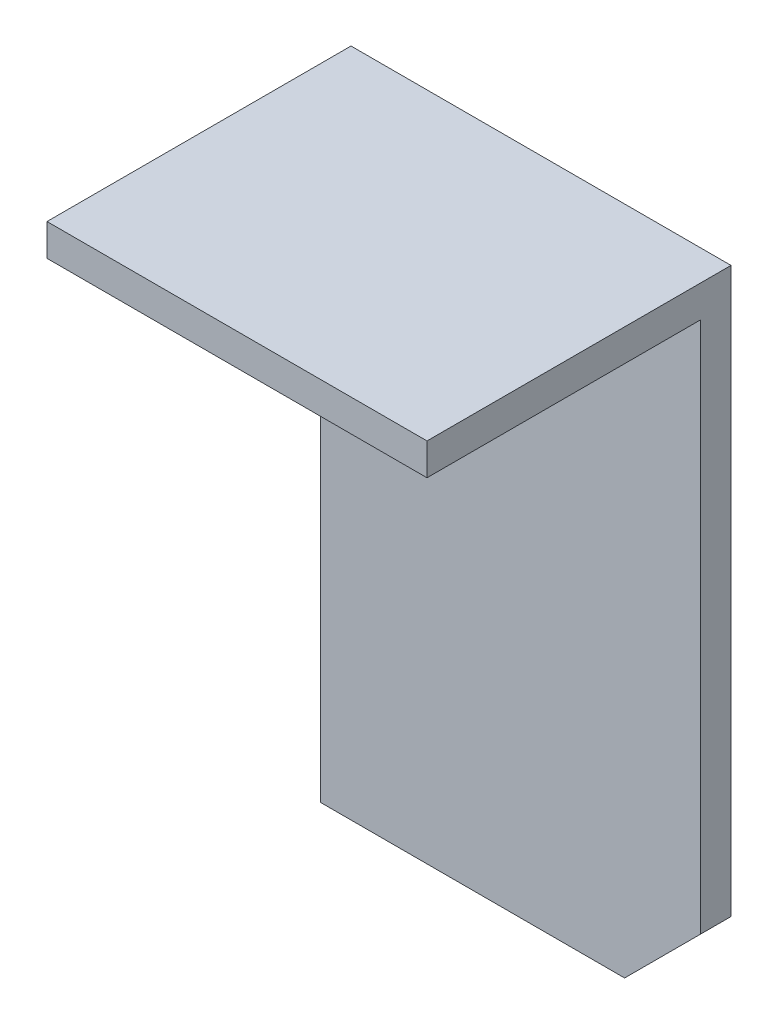
ISO-10303-21;
HEADER;
FILE_DESCRIPTION(('STEP AP214'),'2;1');
FILE_NAME('part.step','',(''),(''),'','','');
FILE_SCHEMA(('AUTOMOTIVE_DESIGN { 1 0 10303 214 1 1 1 1 }'));
ENDSEC;
DATA;
#1=APPLICATION_CONTEXT('core data for automotive mechanical design processes');
#2=APPLICATION_PROTOCOL_DEFINITION('international standard','automotive_design',2000,#1);
#3=PRODUCT_CONTEXT('',#1,'mechanical');
#4=PRODUCT('Part','Part','',(#3));
#5=PRODUCT_RELATED_PRODUCT_CATEGORY('part','',(#4));
#6=PRODUCT_DEFINITION_FORMATION('','',#4);
#7=PRODUCT_DEFINITION_CONTEXT('part definition',#1,'design');
#8=PRODUCT_DEFINITION('design','',#6,#7);
#9=PRODUCT_DEFINITION_SHAPE('','',#8);
#10=(LENGTH_UNIT() NAMED_UNIT(*) SI_UNIT(.MILLI.,.METRE.));
#11=(NAMED_UNIT(*) PLANE_ANGLE_UNIT() SI_UNIT($,.RADIAN.));
#12=(NAMED_UNIT(*) SI_UNIT($,.STERADIAN.) SOLID_ANGLE_UNIT());
#13=UNCERTAINTY_MEASURE_WITH_UNIT(LENGTH_MEASURE(1.E-05),#10,'distance_accuracy_value','');
#14=(GEOMETRIC_REPRESENTATION_CONTEXT(3) GLOBAL_UNCERTAINTY_ASSIGNED_CONTEXT((#13)) GLOBAL_UNIT_ASSIGNED_CONTEXT((#10,
#11,#12)) REPRESENTATION_CONTEXT('',''));
#15=CARTESIAN_POINT('',(0.,0.,0.));
#16=DIRECTION('',(0.,0.,1.));
#17=DIRECTION('',(1.,0.,0.));
#18=AXIS2_PLACEMENT_3D('',#15,#16,#17);
#19=CARTESIAN_POINT('',(0.721679300404558,1.5105,0.2));
#20=DIRECTION('',(0.,0.,1.));
#21=DIRECTION('',(0.,-1.,0.));
#22=AXIS2_PLACEMENT_3D('',#19,#20,#21);
#23=PLANE('',#22);
#24=DIRECTION('',(1.,0.,0.));
#25=VECTOR('',#24,1.);
#26=CARTESIAN_POINT('',(0.721679300404558,1.521,0.2));
#27=LINE('',#26,#25);
#28=CARTESIAN_POINT('',(0.596679300404558,1.521,0.2));
#29=VERTEX_POINT('',#28);
#30=CARTESIAN_POINT('',(0.846679300404558,1.521,0.2));
#31=VERTEX_POINT('',#30);
#32=EDGE_CURVE('E106',#29,#31,#27,.T.);
#33=ORIENTED_EDGE('',*,*,#32,.F.);
#34=DIRECTION('',(0.,-1.,0.));
#35=VECTOR('',#34,1.);
#36=CARTESIAN_POINT('',(0.59667930040456,1.36847101449276,0.2));
#37=LINE('',#36,#35);
#38=CARTESIAN_POINT('',(0.596679300404559,1.5,0.2));
#39=VERTEX_POINT('',#38);
#40=EDGE_CURVE('E153',#29,#39,#37,.T.);
#41=ORIENTED_EDGE('',*,*,#40,.T.);
#42=DIRECTION('',(1.,0.,0.));
#43=VECTOR('',#42,1.);
#44=CARTESIAN_POINT('',(0.721679300404558,1.5,0.2));
#45=LINE('',#44,#43);
#46=CARTESIAN_POINT('',(0.846679300404558,1.5,0.2));
#47=VERTEX_POINT('',#46);
#48=EDGE_CURVE('E11',#39,#47,#45,.T.);
#49=ORIENTED_EDGE('',*,*,#48,.T.);
#50=DIRECTION('',(0.,-1.,0.));
#51=VECTOR('',#50,1.);
#52=CARTESIAN_POINT('',(0.846679300404558,1.39066637478109,0.2));
#53=LINE('',#52,#51);
#54=EDGE_CURVE('E110',#31,#47,#53,.T.);
#55=ORIENTED_EDGE('',*,*,#54,.F.);
#56=EDGE_LOOP('',(#33,#41,#49,#55));
#57=FACE_BOUND('',#56,.T.);
#58=ADVANCED_FACE('F17',(#57),#23,.T.);
#59=CARTESIAN_POINT('',(0.721679300404558,1.5,0.11));
#60=DIRECTION('',(0.,1.,0.));
#61=DIRECTION('',(1.,0.,0.));
#62=AXIS2_PLACEMENT_3D('',#59,#60,#61);
#63=PLANE('',#62);
#64=DIRECTION('',(0.,0.,-1.));
#65=VECTOR('',#64,1.);
#66=CARTESIAN_POINT('',(0.596679300404559,1.5,0.0420289855072459));
#67=LINE('',#66,#65);
#68=CARTESIAN_POINT('',(0.59667930040456,1.5,0.02));
#69=VERTEX_POINT('',#68);
#70=EDGE_CURVE('E149',#39,#69,#67,.T.);
#71=ORIENTED_EDGE('',*,*,#70,.T.);
#72=DIRECTION('',(-1.,0.,0.));
#73=VECTOR('',#72,1.);
#74=CARTESIAN_POINT('',(0.718390642915411,1.5,0.02));
#75=LINE('',#74,#73);
#76=CARTESIAN_POINT('',(0.846679300404558,1.5,0.02));
#77=VERTEX_POINT('',#76);
#78=EDGE_CURVE('E20',#77,#69,#75,.T.);
#79=ORIENTED_EDGE('',*,*,#78,.F.);
#80=DIRECTION('',(0.,0.,-1.));
#81=VECTOR('',#80,1.);
#82=CARTESIAN_POINT('',(0.846679300404558,1.5,0.0448336252189141));
#83=LINE('',#82,#81);
#84=EDGE_CURVE('E163',#47,#77,#83,.T.);
#85=ORIENTED_EDGE('',*,*,#84,.F.);
#86=ORIENTED_EDGE('',*,*,#48,.F.);
#87=EDGE_LOOP('',(#71,#79,#85,#86));
#88=FACE_BOUND('',#87,.T.);
#89=ADVANCED_FACE('F186',(#88),#63,.F.);
#90=CARTESIAN_POINT('',(0.718390642915411,1.30501737448109,0.02));
#91=DIRECTION('',(0.,0.,1.));
#92=DIRECTION('',(0.,-1.,0.));
#93=AXIS2_PLACEMENT_3D('',#90,#91,#92);
#94=PLANE('',#93);
#95=DIRECTION('',(0.,-1.,0.));
#96=VECTOR('',#95,1.);
#97=CARTESIAN_POINT('',(0.59667930040456,1.36847101449276,0.02));
#98=LINE('',#97,#96);
#99=CARTESIAN_POINT('',(0.59667930040456,1.1,0.02));
#100=VERTEX_POINT('',#99);
#101=EDGE_CURVE('E145',#69,#100,#98,.T.);
#102=ORIENTED_EDGE('',*,*,#101,.T.);
#103=DIRECTION('',(1.,0.,0.));
#104=VECTOR('',#103,1.);
#105=CARTESIAN_POINT('',(0.696679300404561,1.1,0.02));
#106=LINE('',#105,#104);
#107=CARTESIAN_POINT('',(0.79667930040456,1.1,0.02));
#108=VERTEX_POINT('',#107);
#109=EDGE_CURVE('E39',#100,#108,#106,.T.);
#110=ORIENTED_EDGE('',*,*,#109,.T.);
#111=DIRECTION('',(0.707106781186552,0.707106781186543,0.));
#112=VECTOR('',#111,1.);
#113=CARTESIAN_POINT('',(0.821679300404559,1.125,0.02));
#114=LINE('',#113,#112);
#115=CARTESIAN_POINT('',(0.84667930040456,1.15,0.02));
#116=VERTEX_POINT('',#115);
#117=EDGE_CURVE('E47',#108,#116,#114,.T.);
#118=ORIENTED_EDGE('',*,*,#117,.T.);
#119=DIRECTION('',(0.,-1.,0.));
#120=VECTOR('',#119,1.);
#121=CARTESIAN_POINT('',(0.846679300404558,1.39066637478109,0.02));
#122=LINE('',#121,#120);
#123=EDGE_CURVE('E140',#77,#116,#122,.T.);
#124=ORIENTED_EDGE('',*,*,#123,.F.);
#125=ORIENTED_EDGE('',*,*,#78,.T.);
#126=EDGE_LOOP('',(#102,#110,#118,#124,#125));
#127=FACE_BOUND('',#126,.T.);
#128=ADVANCED_FACE('F180',(#127),#94,.T.);
#129=CARTESIAN_POINT('',(0.696679300404561,1.1,0.01));
#130=DIRECTION('',(0.,1.,0.));
#131=DIRECTION('',(1.,0.,0.));
#132=AXIS2_PLACEMENT_3D('',#129,#130,#131);
#133=PLANE('',#132);
#134=DIRECTION('',(0.,0.,1.));
#135=VECTOR('',#134,1.);
#136=CARTESIAN_POINT('',(0.79667930040456,1.1,0.01));
#137=LINE('',#136,#135);
#138=CARTESIAN_POINT('',(0.79667930040456,1.1,0.));
#139=VERTEX_POINT('',#138);
#140=EDGE_CURVE('E172',#139,#108,#137,.T.);
#141=ORIENTED_EDGE('',*,*,#140,.T.);
#142=ORIENTED_EDGE('',*,*,#109,.F.);
#143=DIRECTION('',(0.,0.,-1.));
#144=VECTOR('',#143,1.);
#145=CARTESIAN_POINT('',(0.596679300404561,1.1,0.0420289855072459));
#146=LINE('',#145,#144);
#147=CARTESIAN_POINT('',(0.59667930040456,1.1,0.));
#148=VERTEX_POINT('',#147);
#149=EDGE_CURVE('E156',#100,#148,#146,.T.);
#150=ORIENTED_EDGE('',*,*,#149,.T.);
#151=DIRECTION('',(1.,0.,0.));
#152=VECTOR('',#151,1.);
#153=CARTESIAN_POINT('',(0.718495863065479,1.1,0.));
#154=LINE('',#153,#152);
#155=EDGE_CURVE('E136',#148,#139,#154,.T.);
#156=ORIENTED_EDGE('',*,*,#155,.T.);
#157=EDGE_LOOP('',(#141,#142,#150,#156));
#158=FACE_BOUND('',#157,.T.);
#159=ADVANCED_FACE('F192',(#158),#133,.F.);
#160=CARTESIAN_POINT('',(0.821679300404559,1.125,0.01));
#161=DIRECTION('',(-0.707106781186543,0.707106781186552,0.));
#162=DIRECTION('',(0.,0.,1.));
#163=AXIS2_PLACEMENT_3D('',#160,#161,#162);
#164=PLANE('',#163);
#165=DIRECTION('',(0.,0.,-1.));
#166=VECTOR('',#165,1.);
#167=CARTESIAN_POINT('',(0.846679300404559,1.15,0.0448336252189141));
#168=LINE('',#167,#166);
#169=CARTESIAN_POINT('',(0.84667930040456,1.15,0.));
#170=VERTEX_POINT('',#169);
#171=EDGE_CURVE('E116',#116,#170,#168,.T.);
#172=ORIENTED_EDGE('',*,*,#171,.F.);
#173=ORIENTED_EDGE('',*,*,#117,.F.);
#174=ORIENTED_EDGE('',*,*,#140,.F.);
#175=DIRECTION('',(0.707106781186546,0.707106781186549,0.));
#176=VECTOR('',#175,1.);
#177=CARTESIAN_POINT('',(0.79667930040456,1.1,0.));
#178=LINE('',#177,#176);
#179=EDGE_CURVE('E121',#139,#170,#178,.T.);
#180=ORIENTED_EDGE('',*,*,#179,.T.);
#181=EDGE_LOOP('',(#172,#173,#174,#180));
#182=FACE_BOUND('',#181,.T.);
#183=ADVANCED_FACE('F194',(#182),#164,.F.);
#184=CARTESIAN_POINT('',(0.846679300404558,1.39066637478109,0.0448336252189141));
#185=DIRECTION('',(1.,0.,0.));
#186=DIRECTION('',(0.,1.,0.));
#187=AXIS2_PLACEMENT_3D('',#184,#185,#186);
#188=PLANE('',#187);
#189=DIRECTION('',(0.,0.,-1.));
#190=VECTOR('',#189,1.);
#191=CARTESIAN_POINT('',(0.846679300404558,1.521,0.0999999999999988));
#192=LINE('',#191,#190);
#193=CARTESIAN_POINT('',(0.846679300404558,1.521,0.));
#194=VERTEX_POINT('',#193);
#195=EDGE_CURVE('E100',#31,#194,#192,.T.);
#196=ORIENTED_EDGE('',*,*,#195,.F.);
#197=ORIENTED_EDGE('',*,*,#54,.T.);
#198=ORIENTED_EDGE('',*,*,#84,.T.);
#199=ORIENTED_EDGE('',*,*,#123,.T.);
#200=ORIENTED_EDGE('',*,*,#171,.T.);
#201=DIRECTION('',(0.,1.,0.));
#202=VECTOR('',#201,1.);
#203=CARTESIAN_POINT('',(0.84667930040456,1.31559112123516,0.));
#204=LINE('',#203,#202);
#205=EDGE_CURVE('E113',#170,#194,#204,.T.);
#206=ORIENTED_EDGE('',*,*,#205,.T.);
#207=EDGE_LOOP('',(#196,#197,#198,#199,#200,#206));
#208=FACE_BOUND('',#207,.T.);
#209=ADVANCED_FACE('F114',(#208),#188,.T.);
#210=CARTESIAN_POINT('',(0.721679300404558,1.521,0.0999999999999988));
#211=DIRECTION('',(0.,1.,0.));
#212=DIRECTION('',(1.,0.,0.));
#213=AXIS2_PLACEMENT_3D('',#210,#211,#212);
#214=PLANE('',#213);
#215=ORIENTED_EDGE('',*,*,#32,.T.);
#216=ORIENTED_EDGE('',*,*,#195,.T.);
#217=DIRECTION('',(-1.,0.,0.));
#218=VECTOR('',#217,1.);
#219=CARTESIAN_POINT('',(0.718495863065479,1.521,0.));
#220=LINE('',#219,#218);
#221=CARTESIAN_POINT('',(0.596679300404558,1.521,0.));
#222=VERTEX_POINT('',#221);
#223=EDGE_CURVE('E105',#194,#222,#220,.T.);
#224=ORIENTED_EDGE('',*,*,#223,.T.);
#225=DIRECTION('',(0.,0.,1.));
#226=VECTOR('',#225,1.);
#227=CARTESIAN_POINT('',(0.596679300404559,1.521,0.0420289855072459));
#228=LINE('',#227,#226);
#229=EDGE_CURVE('E160',#222,#29,#228,.T.);
#230=ORIENTED_EDGE('',*,*,#229,.T.);
#231=EDGE_LOOP('',(#215,#216,#224,#230));
#232=FACE_BOUND('',#231,.T.);
#233=ADVANCED_FACE('F102',(#232),#214,.T.);
#234=CARTESIAN_POINT('',(0.59667930040456,1.36847101449276,0.0420289855072459));
#235=DIRECTION('',(1.,0.,0.));
#236=DIRECTION('',(0.,1.,0.));
#237=AXIS2_PLACEMENT_3D('',#234,#235,#236);
#238=PLANE('',#237);
#239=ORIENTED_EDGE('',*,*,#101,.F.);
#240=ORIENTED_EDGE('',*,*,#70,.F.);
#241=ORIENTED_EDGE('',*,*,#40,.F.);
#242=ORIENTED_EDGE('',*,*,#229,.F.);
#243=DIRECTION('',(0.,-1.,0.));
#244=VECTOR('',#243,1.);
#245=CARTESIAN_POINT('',(0.596679300404558,1.31559112123516,0.));
#246=LINE('',#245,#244);
#247=EDGE_CURVE('E127',#222,#148,#246,.T.);
#248=ORIENTED_EDGE('',*,*,#247,.T.);
#249=ORIENTED_EDGE('',*,*,#149,.F.);
#250=EDGE_LOOP('',(#239,#240,#241,#242,#248,#249));
#251=FACE_BOUND('',#250,.T.);
#252=ADVANCED_FACE('F190',(#251),#238,.F.);
#253=CARTESIAN_POINT('',(0.718495863065479,1.31559112123516,0.));
#254=DIRECTION('',(0.,0.,1.));
#255=DIRECTION('',(0.,-1.,0.));
#256=AXIS2_PLACEMENT_3D('',#253,#254,#255);
#257=PLANE('',#256);
#258=ORIENTED_EDGE('',*,*,#223,.F.);
#259=ORIENTED_EDGE('',*,*,#205,.F.);
#260=ORIENTED_EDGE('',*,*,#179,.F.);
#261=ORIENTED_EDGE('',*,*,#155,.F.);
#262=ORIENTED_EDGE('',*,*,#247,.F.);
#263=EDGE_LOOP('',(#258,#259,#260,#261,#262));
#264=FACE_BOUND('',#263,.T.);
#265=ADVANCED_FACE('F124',(#264),#257,.F.);
#266=CLOSED_SHELL('',(#58,#89,#128,#159,#183,#209,#233,#252,#265));
#267=MANIFOLD_SOLID_BREP('B1',#266);
#268=ADVANCED_BREP_SHAPE_REPRESENTATION('',(#18,#267),#14);
#269=SHAPE_DEFINITION_REPRESENTATION(#9,#268);
ENDSEC;
END-ISO-10303-21;
